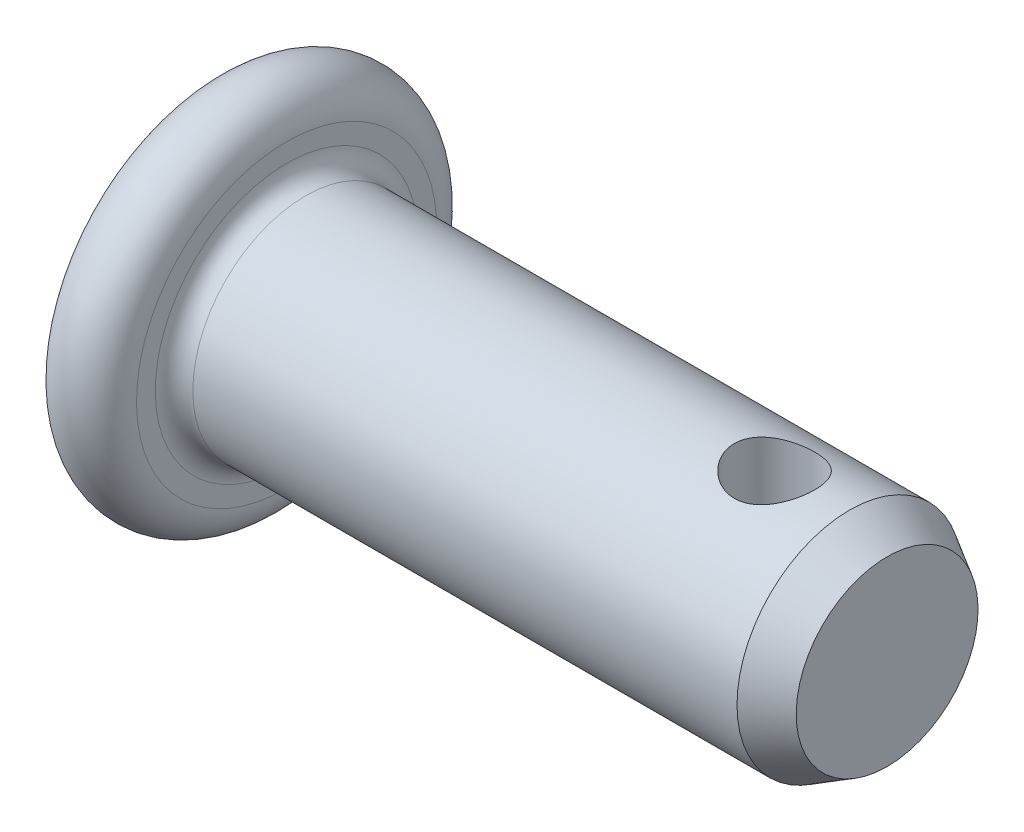
ISO-10303-21;
HEADER;
FILE_DESCRIPTION(('STEP AP214'),'2;1');
FILE_NAME('part.step','',(''),(''),'','','');
FILE_SCHEMA(('AUTOMOTIVE_DESIGN { 1 0 10303 214 1 1 1 1 }'));
ENDSEC;
DATA;
#1=APPLICATION_CONTEXT('core data for automotive mechanical design processes');
#2=APPLICATION_PROTOCOL_DEFINITION('international standard','automotive_design',2000,#1);
#3=PRODUCT_CONTEXT('',#1,'mechanical');
#4=PRODUCT('Part','Part','',(#3));
#5=PRODUCT_RELATED_PRODUCT_CATEGORY('part','',(#4));
#6=PRODUCT_DEFINITION_FORMATION('','',#4);
#7=PRODUCT_DEFINITION_CONTEXT('part definition',#1,'design');
#8=PRODUCT_DEFINITION('design','',#6,#7);
#9=PRODUCT_DEFINITION_SHAPE('','',#8);
#10=(LENGTH_UNIT() NAMED_UNIT(*) SI_UNIT(.MILLI.,.METRE.));
#11=(NAMED_UNIT(*) PLANE_ANGLE_UNIT() SI_UNIT($,.RADIAN.));
#12=(NAMED_UNIT(*) SI_UNIT($,.STERADIAN.) SOLID_ANGLE_UNIT());
#13=UNCERTAINTY_MEASURE_WITH_UNIT(LENGTH_MEASURE(1.E-05),#10,'distance_accuracy_value','');
#14=(GEOMETRIC_REPRESENTATION_CONTEXT(3) GLOBAL_UNCERTAINTY_ASSIGNED_CONTEXT((#13)) GLOBAL_UNIT_ASSIGNED_CONTEXT((#10,
#11,#12)) REPRESENTATION_CONTEXT('',''));
#15=CARTESIAN_POINT('',(0.,0.,0.));
#16=DIRECTION('',(0.,0.,1.));
#17=DIRECTION('',(1.,0.,0.));
#18=AXIS2_PLACEMENT_3D('',#15,#16,#17);
#19=CARTESIAN_POINT('',(18.,0.,0.));
#20=DIRECTION('',(-1.,0.,0.));
#21=DIRECTION('',(0.,-1.,0.));
#22=AXIS2_PLACEMENT_3D('',#19,#20,#21);
#23=PLANE('',#22);
#24=CARTESIAN_POINT('',(18.,0.,0.));
#25=DIRECTION('',(-1.,0.,0.));
#26=DIRECTION('',(0.,-1.,0.));
#27=AXIS2_PLACEMENT_3D('',#24,#25,#26);
#28=CIRCLE('',#27,2.42264973081037);
#29=CARTESIAN_POINT('',(18.,-2.42264973081043,0.));
#30=VERTEX_POINT('',#29);
#31=EDGE_CURVE('E106',#30,#30,#28,.T.);
#32=ORIENTED_EDGE('',*,*,#31,.F.);
#33=EDGE_LOOP('',(#32));
#34=FACE_BOUND('',#33,.T.);
#35=ADVANCED_FACE('F34',(#34),#23,.F.);
#36=CARTESIAN_POINT('',(0.,0.,0.));
#37=DIRECTION('',(1.,0.,0.));
#38=DIRECTION('',(0.,1.,0.));
#39=AXIS2_PLACEMENT_3D('',#36,#37,#38);
#40=PLANE('',#39);
#41=CARTESIAN_POINT('',(0.,0.,0.));
#42=DIRECTION('',(-1.,0.,0.));
#43=DIRECTION('',(0.,-1.,0.));
#44=AXIS2_PLACEMENT_3D('',#41,#42,#43);
#45=CIRCLE('',#44,4.);
#46=CARTESIAN_POINT('',(0.,-4.,0.));
#47=VERTEX_POINT('',#46);
#48=EDGE_CURVE('E51',#47,#47,#45,.T.);
#49=ORIENTED_EDGE('',*,*,#48,.T.);
#50=EDGE_LOOP('',(#49));
#51=FACE_BOUND('',#50,.T.);
#52=ADVANCED_FACE('F80',(#51),#40,.F.);
#53=CARTESIAN_POINT('',(1.,0.,0.));
#54=DIRECTION('',(-1.,0.,0.));
#55=DIRECTION('',(0.,-1.,0.));
#56=AXIS2_PLACEMENT_3D('',#53,#54,#55);
#57=TOROIDAL_SURFACE('',#56,4.,1.);
#58=ORIENTED_EDGE('',*,*,#48,.F.);
#59=EDGE_LOOP('',(#58));
#60=FACE_BOUND('',#59,.T.);
#61=CARTESIAN_POINT('',(2.,0.,0.));
#62=DIRECTION('',(-1.,0.,0.));
#63=DIRECTION('',(0.,-1.,0.));
#64=AXIS2_PLACEMENT_3D('',#61,#62,#63);
#65=CIRCLE('',#64,4.);
#66=CARTESIAN_POINT('',(2.,-4.,0.));
#67=VERTEX_POINT('',#66);
#68=EDGE_CURVE('E100',#67,#67,#65,.T.);
#69=ORIENTED_EDGE('',*,*,#68,.T.);
#70=EDGE_LOOP('',(#69));
#71=FACE_BOUND('',#70,.T.);
#72=ADVANCED_FACE('F85',(#60,#71),#57,.T.);
#73=CARTESIAN_POINT('',(2.,2.99999999999995,0.));
#74=DIRECTION('',(-1.,0.,0.));
#75=DIRECTION('',(0.,-1.,0.));
#76=AXIS2_PLACEMENT_3D('',#73,#74,#75);
#77=PLANE('',#76);
#78=CARTESIAN_POINT('',(2.,0.,0.));
#79=DIRECTION('',(-1.,0.,0.));
#80=DIRECTION('',(0.,-1.,0.));
#81=AXIS2_PLACEMENT_3D('',#78,#79,#80);
#82=CIRCLE('',#81,3.5);
#83=CARTESIAN_POINT('',(2.,-3.5,0.));
#84=VERTEX_POINT('',#83);
#85=EDGE_CURVE('E46',#84,#84,#82,.T.);
#86=ORIENTED_EDGE('',*,*,#85,.T.);
#87=EDGE_LOOP('',(#86));
#88=FACE_BOUND('',#87,.T.);
#89=ORIENTED_EDGE('',*,*,#68,.F.);
#90=EDGE_LOOP('',(#89));
#91=FACE_BOUND('',#90,.T.);
#92=ADVANCED_FACE('F75',(#88,#91),#77,.F.);
#93=CARTESIAN_POINT('',(-19.830028721469,0.,0.));
#94=DIRECTION('',(-1.,0.,0.));
#95=DIRECTION('',(0.,-1.,0.));
#96=AXIS2_PLACEMENT_3D('',#93,#94,#95);
#97=CYLINDRICAL_SURFACE('',#96,3.);
#98=CARTESIAN_POINT('',(16.07,-3.,0.));
#99=CARTESIAN_POINT('',(16.0700011876972,-3.00000085236087,-0.058144423666869));
#100=CARTESIAN_POINT('',(16.0652454821601,-2.99829449507252,-0.116280392908699));
#101=CARTESIAN_POINT('',(16.0464167005906,-2.99165685483226,-0.230825968284262));
#102=CARTESIAN_POINT('',(16.0323439537525,-2.98672568582107,-0.287235635338894));
#103=CARTESIAN_POINT('',(15.9954346036703,-2.97417071234845,-0.396660648281995));
#104=CARTESIAN_POINT('',(15.9726138998507,-2.96655179486501,-0.449681949736998));
#105=CARTESIAN_POINT('',(15.9189332388163,-2.9493885850676,-0.551142422044839));
#106=CARTESIAN_POINT('',(15.8880713620351,-2.93984383314672,-0.599580495033483));
#107=CARTESIAN_POINT('',(15.8179248823826,-2.91940714032655,-0.692387327079761));
#108=CARTESIAN_POINT('',(15.7783824473048,-2.90847964888084,-0.736553318241095));
#109=CARTESIAN_POINT('',(15.6925449030633,-2.8866931070696,-0.81778664798658));
#110=CARTESIAN_POINT('',(15.6462480088812,-2.87583407559,-0.854852104086118));
#111=CARTESIAN_POINT('',(15.5463055685407,-2.85501068982929,-0.922060907926777));
#112=CARTESIAN_POINT('',(15.4924646657491,-2.84508892880969,-0.95192824795313));
#113=CARTESIAN_POINT('',(15.380113472799,-2.82781091223996,-1.00209513842951));
#114=CARTESIAN_POINT('',(15.3216048547123,-2.82045374302605,-1.02239809720236));
#115=CARTESIAN_POINT('',(15.2039019833382,-2.80951535958253,-1.0520772757923));
#116=CARTESIAN_POINT('',(15.1448172357285,-2.80580193327049,-1.061837496832));
#117=CARTESIAN_POINT('',(15.0257409145972,-2.80218256017483,-1.07135492754185));
#118=CARTESIAN_POINT('',(14.9657496791047,-2.80227522749677,-1.07111577823372));
#119=CARTESIAN_POINT('',(14.8499646708127,-2.80614272311344,-1.06093690056894));
#120=CARTESIAN_POINT('',(14.7941176270585,-2.8097209864696,-1.05151500443456));
#121=CARTESIAN_POINT('',(14.684856523547,-2.81983209908783,-1.02408901959706));
#122=CARTESIAN_POINT('',(14.631442796367,-2.82636535090167,-1.00608376158285));
#123=CARTESIAN_POINT('',(14.5274547890558,-2.84177828691622,-0.961693602686314));
#124=CARTESIAN_POINT('',(14.4769475973174,-2.85069749916808,-0.935165865592659));
#125=CARTESIAN_POINT('',(14.3809452449066,-2.86986267945414,-0.87458307874809));
#126=CARTESIAN_POINT('',(14.3354516997629,-2.88010907284083,-0.840525613286151));
#127=CARTESIAN_POINT('',(14.2478812607032,-2.90152902086692,-0.763427644942869));
#128=CARTESIAN_POINT('',(14.206176106455,-2.91272121621957,-0.719969138346304));
#129=CARTESIAN_POINT('',(14.1305412101273,-2.93423605096058,-0.626541431645276));
#130=CARTESIAN_POINT('',(14.096612445826,-2.94455858089692,-0.576571414042039));
#131=CARTESIAN_POINT('',(14.037134911732,-2.96334280106687,-0.470663813489885));
#132=CARTESIAN_POINT('',(14.0116989156008,-2.97177899260394,-0.414658057712955));
#133=CARTESIAN_POINT('',(13.9707295339137,-2.98565291760963,-0.298787834826394));
#134=CARTESIAN_POINT('',(13.9551921867146,-2.99109185052506,-0.238924922006367));
#135=CARTESIAN_POINT('',(13.9351502569951,-2.99815307150106,-0.120176713024151));
#136=CARTESIAN_POINT('',(13.9301443365055,-2.99994863872934,-0.0613862385931865));
#137=CARTESIAN_POINT('',(13.9298619122213,-3.00004913258422,0.0562146696397162));
#138=CARTESIAN_POINT('',(13.9345834909012,-2.99835474716499,0.115025097223515));
#139=CARTESIAN_POINT('',(13.9532334090568,-2.99178024275438,0.228902798115562));
#140=CARTESIAN_POINT('',(13.966842749204,-2.9870105745617,0.284029339909927));
#141=CARTESIAN_POINT('',(14.0024714986184,-2.97487542105584,0.391185719351866));
#142=CARTESIAN_POINT('',(14.0244919996437,-2.96750959877466,0.443215153985021));
#143=CARTESIAN_POINT('',(14.076998231449,-2.95066063760266,0.544338996176909));
#144=CARTESIAN_POINT('',(14.107704982926,-2.94112369208751,0.593309412151453));
#145=CARTESIAN_POINT('',(14.1764581116928,-2.92100017959604,0.685558726346856));
#146=CARTESIAN_POINT('',(14.2145070016372,-2.91041325389607,0.728835667573616));
#147=CARTESIAN_POINT('',(14.2992134462063,-2.88867484913535,0.81083378881719));
#148=CARTESIAN_POINT('',(14.3462173600148,-2.87752282581946,0.849197933367082));
#149=CARTESIAN_POINT('',(14.4462261994024,-2.8564629221253,0.917552598759221));
#150=CARTESIAN_POINT('',(14.4992314120457,-2.84655510130966,0.947542718802958));
#151=CARTESIAN_POINT('',(14.6099668619782,-2.82917636910102,0.998240487223753));
#152=CARTESIAN_POINT('',(14.6677017385475,-2.82170788711406,1.01893888935085));
#153=CARTESIAN_POINT('',(14.7861729264571,-2.81022365284708,1.05020274987971));
#154=CARTESIAN_POINT('',(14.8469075987408,-2.80620603664482,1.06077367880804));
#155=CARTESIAN_POINT('',(14.9658279695292,-2.80231029733874,1.0710201164459));
#156=CARTESIAN_POINT('',(15.0239548678003,-2.80220371006754,1.0712969706672));
#157=CARTESIAN_POINT('',(15.1393796330134,-2.80556573589995,1.0624607102675));
#158=CARTESIAN_POINT('',(15.1966775637668,-2.80903407231604,1.0533483223435));
#159=CARTESIAN_POINT('',(15.3073786660326,-2.81897366332915,1.02644235659176));
#160=CARTESIAN_POINT('',(15.3608433391118,-2.8253678500847,1.00887100662089));
#161=CARTESIAN_POINT('',(15.4641022604648,-2.84040087461517,0.965733956056557));
#162=CARTESIAN_POINT('',(15.5138956232391,-2.84904025165861,0.940166334551411));
#163=CARTESIAN_POINT('',(15.6110273518143,-2.86811343709821,0.880315920251316));
#164=CARTESIAN_POINT('',(15.658128580184,-2.8786140770728,0.845669776577137));
#165=CARTESIAN_POINT('',(15.7460418476776,-2.89997524804005,0.769231276304866));
#166=CARTESIAN_POINT('',(15.7868519805052,-2.91083588691124,0.727436761704332));
#167=CARTESIAN_POINT('',(15.8629720193145,-2.93230677789552,0.635533564492599));
#168=CARTESIAN_POINT('',(15.8979330046734,-2.94288123522131,0.585126317810536));
#169=CARTESIAN_POINT('',(15.9588615768249,-2.96203926538255,0.478788097154143));
#170=CARTESIAN_POINT('',(15.9848298787494,-2.97062299651006,0.422857562867152));
#171=CARTESIAN_POINT('',(16.0269245871362,-2.98484138608744,0.306830038273005));
#172=CARTESIAN_POINT('',(16.0430193844934,-2.99046656489372,0.246720345464807));
#173=CARTESIAN_POINT('',(16.0645543914338,-2.99804470450516,0.12440332890638));
#174=CARTESIAN_POINT('',(16.0699987295257,-2.99999908823343,0.0621968274718988));
#175=CARTESIAN_POINT('',(16.07,-3.,0.));
#176=B_SPLINE_CURVE_WITH_KNOTS('',3,(#98,#99,#100,#101,#102,#103,#104,#105,#106,#107,#108,#109,
#110,#111,#112,#113,#114,#115,#116,#117,#118,#119,#120,#121,#122,#123,#124,#125,#126,#127,#128,
#129,#130,#131,#132,#133,#134,#135,#136,#137,#138,#139,#140,#141,#142,#143,#144,#145,#146,#147,
#148,#149,#150,#151,#152,#153,#154,#155,#156,#157,#158,#159,#160,#161,#162,#163,#164,#165,#166,
#167,#168,#169,#170,#171,#172,#173,#174,#175),.UNSPECIFIED.,.T.,.F.,(4,2,2,2,2,2,2,2,2,2,2,2,2,
2,2,2,2,2,2,2,2,2,2,2,2,2,2,2,2,2,2,2,2,2,2,2,2,2,4),(0.,0.174204089504532,0.348402024271792,
0.522284843760348,0.696209210160618,0.876244346087828,1.05632714683893,1.2424909270914,
1.42858831652128,1.60765161756257,1.78664971772959,1.95610515861384,2.12558369100685,
2.29806543907974,2.4706026037934,2.65354951370583,2.83651941416969,3.0218303568422,
3.20706708759121,3.38326542768564,3.55942903814491,3.72959363217541,3.89978032086942,
4.07476186396804,4.24980339646151,4.4340071961305,4.61821981067198,4.80261533224662,
4.98691119319729,5.16042307890208,5.3339215363567,5.5030919729269,5.67230307987667,
5.84974282452726,6.02723623083889,6.21307677666714,6.3989025403633,6.58532014499971,
6.77166547300382),.UNSPECIFIED.);
#177=CARTESIAN_POINT('',(16.07,-3.,0.));
#178=VERTEX_POINT('',#177);
#179=EDGE_CURVE('E38',#178,#178,#176,.T.);
#180=ORIENTED_EDGE('',*,*,#179,.T.);
#181=EDGE_LOOP('',(#180));
#182=FACE_BOUND('',#181,.T.);
#183=CARTESIAN_POINT('',(15.,2.80269513147602,1.07000000000002));
#184=CARTESIAN_POINT('',(14.9419887063329,2.80269405453391,1.07000123254072));
#185=CARTESIAN_POINT('',(14.8839859386846,2.80451586869681,1.0652664525254));
#186=CARTESIAN_POINT('',(14.7697155758882,2.81156129057407,1.04652836683267));
#187=CARTESIAN_POINT('',(14.713448070444,2.81678507384475,1.03252458283392));
#188=CARTESIAN_POINT('',(14.6043259729849,2.82996906177154,0.995816550026912));
#189=CARTESIAN_POINT('',(14.5514641874673,2.83792325812037,0.973131392204463));
#190=CARTESIAN_POINT('',(14.4502774278851,2.85566258920245,0.919771193393076));
#191=CARTESIAN_POINT('',(14.4019536704409,2.86544821283874,0.889094018060511));
#192=CARTESIAN_POINT('',(14.3090459972175,2.8862400916644,0.819145873119154));
#193=CARTESIAN_POINT('',(14.2646949699834,2.89727985145857,0.779575453093979));
#194=CARTESIAN_POINT('',(14.1830966677932,2.91905497372725,0.693601114916287));
#195=CARTESIAN_POINT('',(14.1458507295916,2.92979027859867,0.647195913769623));
#196=CARTESIAN_POINT('',(14.0784278603396,2.9501404572587,0.547130932879786));
#197=CARTESIAN_POINT('',(14.0484999324569,2.95971140880337,0.493293649872807));
#198=CARTESIAN_POINT('',(13.9982202526059,2.97625540699166,0.380947716416266));
#199=CARTESIAN_POINT('',(13.9778655186337,2.98322926247712,0.322440527271246));
#200=CARTESIAN_POINT('',(13.948114479253,2.99355571699263,0.204861066126784));
#201=CARTESIAN_POINT('',(13.9383181349319,2.99704012644875,0.145901813302216));
#202=CARTESIAN_POINT('',(13.9286846223207,3.00046579172435,0.0270801621463254));
#203=CARTESIAN_POINT('',(13.9288445223153,3.00040809055365,-0.0327819651339541));
#204=CARTESIAN_POINT('',(13.9388765441917,2.99684237892633,-0.148859102673258));
#205=CARTESIAN_POINT('',(13.9483130279596,2.99348913261428,-0.205117321064728));
#206=CARTESIAN_POINT('',(13.9759031818784,2.98390815583309,-0.315191872236592));
#207=CARTESIAN_POINT('',(13.9940574604263,2.9776802247468,-0.369008034303972));
#208=CARTESIAN_POINT('',(14.0387932090632,2.96286490572018,-0.473561943092263));
#209=CARTESIAN_POINT('',(14.065489159384,2.95424569011266,-0.524246010565714));
#210=CARTESIAN_POINT('',(14.1264525324705,2.93553145734558,-0.62053569600277));
#211=CARTESIAN_POINT('',(14.160722258636,2.92543599153323,-0.666139762634494));
#212=CARTESIAN_POINT('',(14.2380038453613,2.90418445697603,-0.753554237358191));
#213=CARTESIAN_POINT('',(14.2813847831371,2.89300053975559,-0.795032073482281));
#214=CARTESIAN_POINT('',(14.3745676367302,2.87127425409416,-0.870241508433912));
#215=CARTESIAN_POINT('',(14.4243708601758,2.86073201694955,-0.903971525843579));
#216=CARTESIAN_POINT('',(14.5301782703851,2.84131733682181,-0.963281437747404));
#217=CARTESIAN_POINT('',(14.5862796479569,2.83247916578313,-0.988700048233308));
#218=CARTESIAN_POINT('',(14.7023634377384,2.81786849291995,-1.02960898278534));
#219=CARTESIAN_POINT('',(14.7623439199073,2.81209447949583,-1.04510420300562));
#220=CARTESIAN_POINT('',(14.8812241841887,2.80461577891204,-1.06500624370511));
#221=CARTESIAN_POINT('',(14.9400243448385,2.8027194562484,-1.06993586022502));
#222=CARTESIAN_POINT('',(15.0576295621054,2.80267129757257,-1.07006285392978));
#223=CARTESIAN_POINT('',(15.1164346148853,2.80451864836438,-1.06526234468013));
#224=CARTESIAN_POINT('',(15.2298406281345,2.81155662180319,-1.04653762268767));
#225=CARTESIAN_POINT('',(15.2845149112386,2.81660599926516,-1.03299845351074));
#226=CARTESIAN_POINT('',(15.390797458923,2.82931702532804,-0.997654939685819));
#227=CARTESIAN_POINT('',(15.4424051301973,2.83697917750986,-0.975849001626886));
#228=CARTESIAN_POINT('',(15.5430961915697,2.85438354951195,-0.923727528517056));
#229=CARTESIAN_POINT('',(15.5920278822408,2.86418921830279,-0.893140721738138));
#230=CARTESIAN_POINT('',(15.6842514327376,2.8846618744957,-0.824622682092581));
#231=CARTESIAN_POINT('',(15.7275413965204,2.89532914952109,-0.786688990715984));
#232=CARTESIAN_POINT('',(15.8097787176061,2.91704972348046,-0.702020910478861));
#233=CARTESIAN_POINT('',(15.8483439901028,2.92809090996236,-0.654911093611328));
#234=CARTESIAN_POINT('',(15.9170580182629,2.9487317223207,-0.55461598294175));
#235=CARTESIAN_POINT('',(15.9472069184723,2.95833137295334,-0.501430793502712));
#236=CARTESIAN_POINT('',(15.9979907902605,2.97498086653622,-0.390648793902459));
#237=CARTESIAN_POINT('',(16.0186741109116,2.98204362685798,-0.333076196099852));
#238=CARTESIAN_POINT('',(16.04996136586,2.9928750118385,-0.21496327995016));
#239=CARTESIAN_POINT('',(16.0605695320171,2.99664501949617,-0.154424218850748));
#240=CARTESIAN_POINT('',(16.0709823447268,3.00034699208309,-0.0355680943413864));
#241=CARTESIAN_POINT('',(16.0713321682796,3.00047263193117,0.0226956413885357));
#242=CARTESIAN_POINT('',(16.0625946649115,2.99736395549756,0.138413857875164));
#243=CARTESIAN_POINT('',(16.0535082992325,2.9941299814516,0.195868420456148));
#244=CARTESIAN_POINT('',(16.0265311891147,2.98474651147736,0.307159445381015));
#245=CARTESIAN_POINT('',(16.0088233654925,2.9786576819742,0.361045741280894));
#246=CARTESIAN_POINT('',(15.9652818790851,2.96419445462513,0.465094975532221));
#247=CARTESIAN_POINT('',(15.9394466943722,2.95581962874304,0.515257214341394));
#248=CARTESIAN_POINT('',(15.8792017971978,2.93721704081451,0.612626965016697));
#249=CARTESIAN_POINT('',(15.8444904984025,2.92692857167366,0.659636090831127));
#250=CARTESIAN_POINT('',(15.7679706000018,2.90577498628154,0.747335553361941));
#251=CARTESIAN_POINT('',(15.7261595778756,2.89490967407641,0.788023724179216));
#252=CARTESIAN_POINT('',(15.6343075816394,2.87321542156454,0.863864985979199));
#253=CARTESIAN_POINT('',(15.5839741575495,2.86241170542813,0.898672367484267));
#254=CARTESIAN_POINT('',(15.4778301251637,2.84265870027645,0.959329695321797));
#255=CARTESIAN_POINT('',(15.4220199099602,2.83370927831394,0.985180283918414));
#256=CARTESIAN_POINT('',(15.3062385239419,2.8187910851282,1.02709198290552));
#257=CARTESIAN_POINT('',(15.2462549471952,2.81283167439828,1.04312238452109));
#258=CARTESIAN_POINT('',(15.1241769470664,2.80478523843412,1.06457309057975));
#259=CARTESIAN_POINT('',(15.0620835910041,2.80269628401769,1.06999868093698));
#260=CARTESIAN_POINT('',(15.,2.80269513147602,1.07000000000002));
#261=B_SPLINE_CURVE_WITH_KNOTS('',3,(#183,#184,#185,#186,#187,#188,#189,#190,#191,#192,#193,
#194,#195,#196,#197,#198,#199,#200,#201,#202,#203,#204,#205,#206,#207,#208,#209,#210,#211,#212,
#213,#214,#215,#216,#217,#218,#219,#220,#221,#222,#223,#224,#225,#226,#227,#228,#229,#230,#231,
#232,#233,#234,#235,#236,#237,#238,#239,#240,#241,#242,#243,#244,#245,#246,#247,#248,#249,#250,
#251,#252,#253,#254,#255,#256,#257,#258,#259,#260),.UNSPECIFIED.,.T.,.F.,(4,2,2,2,2,2,2,2,2,2,2,
2,2,2,2,2,2,2,2,2,2,2,2,2,2,2,2,2,2,2,2,2,2,2,2,2,2,2,4),(0.,0.173803272155467,
0.347615514022831,0.52104770609046,0.694526262424325,0.875079612774939,1.05566689908118,
1.24173792683392,1.42775095590534,1.60643756309917,1.78507155449095,1.95569889276221,
2.12633814049463,2.29936758297185,2.47244972119667,2.65477340417334,2.83713426848316,
3.02284867184576,3.20847137385509,3.38467433504891,3.56083902576235,3.72972725558058,
3.89864805499092,4.07348466528656,4.24837988308275,4.43312891642292,4.61787477661345,
4.80166614498403,4.98538028141725,5.15931221552369,5.33322643334238,5.50360170838116,
5.67400890686085,5.85123086199185,6.02851340958717,6.21404625791439,6.39956579949527,
6.58566255796006,6.77166653376499),.UNSPECIFIED.);
#262=CARTESIAN_POINT('',(15.,2.80269513147602,1.07000000000002));
#263=VERTEX_POINT('',#262);
#264=EDGE_CURVE('E54',#263,#263,#261,.T.);
#265=ORIENTED_EDGE('',*,*,#264,.T.);
#266=EDGE_LOOP('',(#265));
#267=FACE_BOUND('',#266,.T.);
#268=CARTESIAN_POINT('',(2.5,0.,0.));
#269=DIRECTION('',(-1.,0.,0.));
#270=DIRECTION('',(0.,-1.,0.));
#271=AXIS2_PLACEMENT_3D('',#268,#269,#270);
#272=CIRCLE('',#271,3.);
#273=CARTESIAN_POINT('',(2.5,-3.,0.));
#274=VERTEX_POINT('',#273);
#275=EDGE_CURVE('E10',#274,#274,#272,.F.);
#276=ORIENTED_EDGE('',*,*,#275,.T.);
#277=EDGE_LOOP('',(#276));
#278=FACE_BOUND('',#277,.T.);
#279=CARTESIAN_POINT('',(17.,0.,0.));
#280=DIRECTION('',(-1.,0.,0.));
#281=DIRECTION('',(0.,-1.,0.));
#282=AXIS2_PLACEMENT_3D('',#279,#280,#281);
#283=CIRCLE('',#282,3.);
#284=CARTESIAN_POINT('',(17.,-3.,0.));
#285=VERTEX_POINT('',#284);
#286=EDGE_CURVE('E102',#285,#285,#283,.T.);
#287=ORIENTED_EDGE('',*,*,#286,.T.);
#288=EDGE_LOOP('',(#287));
#289=FACE_BOUND('',#288,.T.);
#290=ADVANCED_FACE('F58',(#182,#267,#278,#289),#97,.T.);
#291=CARTESIAN_POINT('',(18.,0.,0.));
#292=DIRECTION('',(-1.,0.,0.));
#293=DIRECTION('',(0.,-1.,0.));
#294=AXIS2_PLACEMENT_3D('',#291,#292,#293);
#295=CONICAL_SURFACE('',#294,2.42264973081037,0.5235987755983);
#296=ORIENTED_EDGE('',*,*,#286,.F.);
#297=EDGE_LOOP('',(#296));
#298=FACE_BOUND('',#297,.T.);
#299=ORIENTED_EDGE('',*,*,#31,.T.);
#300=EDGE_LOOP('',(#299));
#301=FACE_BOUND('',#300,.T.);
#302=ADVANCED_FACE('F66',(#298,#301),#295,.T.);
#303=CARTESIAN_POINT('',(2.5,0.,0.));
#304=DIRECTION('',(-1.,0.,0.));
#305=DIRECTION('',(0.,-1.,0.));
#306=AXIS2_PLACEMENT_3D('',#303,#304,#305);
#307=TOROIDAL_SURFACE('',#306,3.5,0.5);
#308=ORIENTED_EDGE('',*,*,#275,.F.);
#309=EDGE_LOOP('',(#308));
#310=FACE_BOUND('',#309,.T.);
#311=ORIENTED_EDGE('',*,*,#85,.F.);
#312=EDGE_LOOP('',(#311));
#313=FACE_BOUND('',#312,.T.);
#314=ADVANCED_FACE('F36',(#310,#313),#307,.F.);
#315=CARTESIAN_POINT('',(15.,-5.00000000000014,0.));
#316=DIRECTION('',(0.,1.,0.));
#317=DIRECTION('',(0.,0.,1.));
#318=AXIS2_PLACEMENT_3D('',#315,#316,#317);
#319=CYLINDRICAL_SURFACE('',#318,1.07);
#320=ORIENTED_EDGE('',*,*,#264,.F.);
#321=EDGE_LOOP('',(#320));
#322=FACE_BOUND('',#321,.T.);
#323=ORIENTED_EDGE('',*,*,#179,.F.);
#324=EDGE_LOOP('',(#323));
#325=FACE_BOUND('',#324,.T.);
#326=ADVANCED_FACE('F62',(#322,#325),#319,.F.);
#327=CLOSED_SHELL('',(#35,#52,#72,#92,#290,#302,#314,#326));
#328=MANIFOLD_SOLID_BREP('B2',#327);
#329=ADVANCED_BREP_SHAPE_REPRESENTATION('',(#18,#328),#14);
#330=SHAPE_DEFINITION_REPRESENTATION(#9,#329);
ENDSEC;
END-ISO-10303-21;
